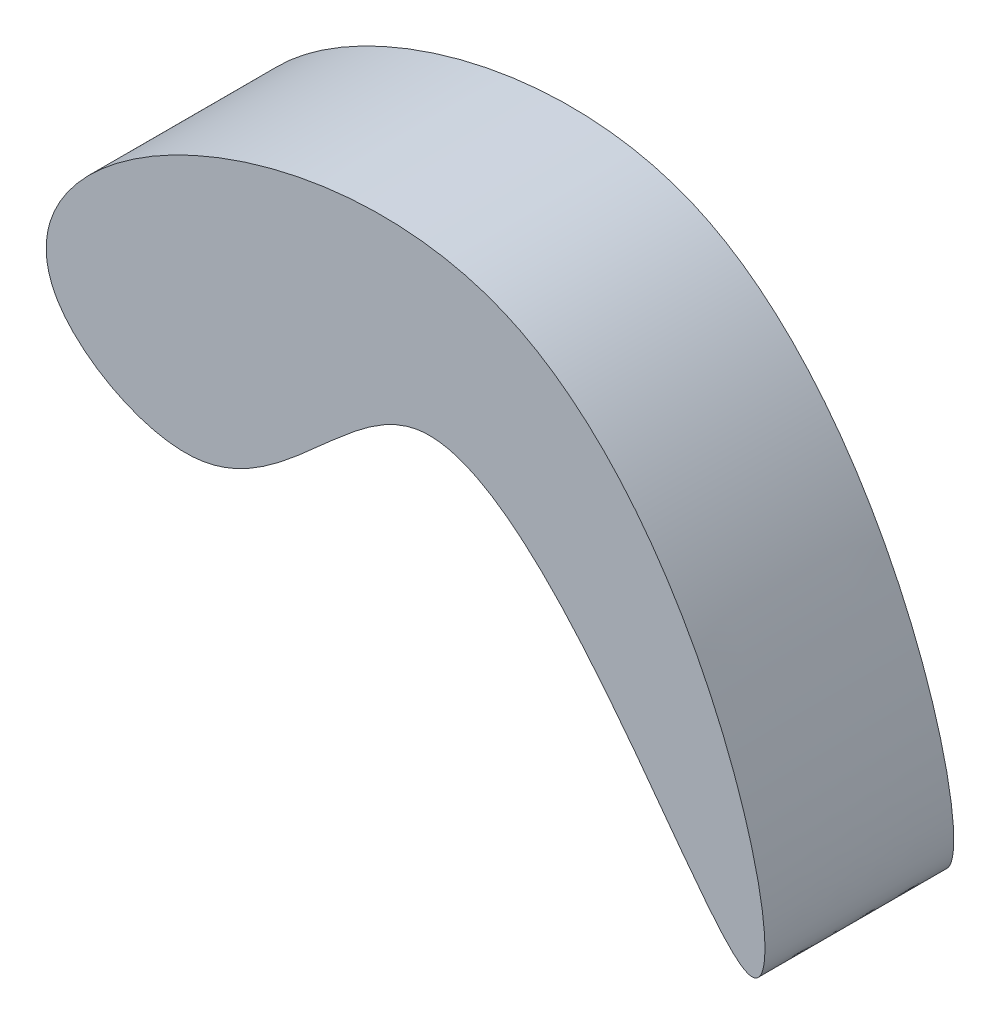
ISO-10303-21;
HEADER;
FILE_DESCRIPTION(('STEP AP214'),'2;1');
FILE_NAME('part.step','',(''),(''),'','','');
FILE_SCHEMA(('AUTOMOTIVE_DESIGN { 1 0 10303 214 1 1 1 1 }'));
ENDSEC;
DATA;
#1=APPLICATION_CONTEXT('core data for automotive mechanical design processes');
#2=APPLICATION_PROTOCOL_DEFINITION('international standard','automotive_design',2000,#1);
#3=PRODUCT_CONTEXT('',#1,'mechanical');
#4=PRODUCT('Part','Part','',(#3));
#5=PRODUCT_RELATED_PRODUCT_CATEGORY('part','',(#4));
#6=PRODUCT_DEFINITION_FORMATION('','',#4);
#7=PRODUCT_DEFINITION_CONTEXT('part definition',#1,'design');
#8=PRODUCT_DEFINITION('design','',#6,#7);
#9=PRODUCT_DEFINITION_SHAPE('','',#8);
#10=(LENGTH_UNIT() NAMED_UNIT(*) SI_UNIT(.MILLI.,.METRE.));
#11=(NAMED_UNIT(*) PLANE_ANGLE_UNIT() SI_UNIT($,.RADIAN.));
#12=(NAMED_UNIT(*) SI_UNIT($,.STERADIAN.) SOLID_ANGLE_UNIT());
#13=UNCERTAINTY_MEASURE_WITH_UNIT(LENGTH_MEASURE(1.E-05),#10,'distance_accuracy_value','');
#14=(GEOMETRIC_REPRESENTATION_CONTEXT(3) GLOBAL_UNCERTAINTY_ASSIGNED_CONTEXT((#13)) GLOBAL_UNIT_ASSIGNED_CONTEXT((#10,
#11,#12)) REPRESENTATION_CONTEXT('',''));
#15=CARTESIAN_POINT('',(0.,0.,0.));
#16=DIRECTION('',(0.,0.,1.));
#17=DIRECTION('',(1.,0.,0.));
#18=AXIS2_PLACEMENT_3D('',#15,#16,#17);
#19=CARTESIAN_POINT('',(3.56664575303966,23.2194553590261,-10.));
#20=CARTESIAN_POINT('',(5.69515383684165,19.7726400859584,-10.));
#21=CARTESIAN_POINT('',(20.7568728150862,11.5808963935715,-10.));
#22=CARTESIAN_POINT('',(39.2452653300195,47.1042954283447,-10.));
#23=CARTESIAN_POINT('',(77.5982814444877,-28.8795470727316,-10.));
#24=CARTESIAN_POINT('',(55.2870831732471,66.6804112958299,-10.));
#25=CARTESIAN_POINT('',(-3.34221028566064,34.4073623699699,-10.));
#26=CARTESIAN_POINT('',(3.56664575303966,23.2194553590261,-10.));
#27=B_SPLINE_CURVE_WITH_KNOTS('',3,(#19,#20,#21,#22,#23,#24,#25,#26),.UNSPECIFIED.,.T.,.F.,(4,1,
1,1,1,4),(0.,0.0814706657795032,0.222276328373781,0.462196474158908,0.735556982127009,1.),.UNSPECIFIED.);
#28=DIRECTION('',(0.,0.,1.));
#29=VECTOR('',#28,1.);
#30=SURFACE_OF_LINEAR_EXTRUSION('',#27,#29);
#31=CARTESIAN_POINT('',(3.56664575303966,23.2194553590261,-10.));
#32=VERTEX_POINT('',#31);
#33=EDGE_CURVE('E10',#32,#32,#27,.T.);
#34=ORIENTED_EDGE('',*,*,#33,.T.);
#35=EDGE_LOOP('',(#34));
#36=FACE_BOUND('',#35,.T.);
#37=CARTESIAN_POINT('',(3.56664575303966,23.2194553590261,6.99999999999999));
#38=CARTESIAN_POINT('',(5.69515383684165,19.7726400859584,6.99999999999999));
#39=CARTESIAN_POINT('',(20.7568728150862,11.5808963935715,6.99999999999999));
#40=CARTESIAN_POINT('',(39.2452653300195,47.1042954283447,6.99999999999999));
#41=CARTESIAN_POINT('',(77.5982814444877,-28.8795470727316,6.99999999999999));
#42=CARTESIAN_POINT('',(55.2870831732471,66.6804112958299,6.99999999999999));
#43=CARTESIAN_POINT('',(-3.34221028566064,34.4073623699699,6.99999999999999));
#44=CARTESIAN_POINT('',(3.56664575303966,23.2194553590261,6.99999999999999));
#45=B_SPLINE_CURVE_WITH_KNOTS('',3,(#37,#38,#39,#40,#41,#42,#43,#44),.UNSPECIFIED.,.T.,.F.,(4,1,
1,1,1,4),(0.,0.0814706657795032,0.222276328373781,0.462196474158908,0.735556982127009,1.),.UNSPECIFIED.);
#46=CARTESIAN_POINT('',(3.56664575303966,23.2194553590261,6.99999999999999));
#47=VERTEX_POINT('',#46);
#48=EDGE_CURVE('E40',#47,#47,#45,.T.);
#49=ORIENTED_EDGE('',*,*,#48,.F.);
#50=EDGE_LOOP('',(#49));
#51=FACE_BOUND('',#50,.T.);
#52=ADVANCED_FACE('F31',(#36,#51),#30,.T.);
#53=CARTESIAN_POINT('',(67.140105202635,3.14654257477529,-10.));
#54=DIRECTION('',(0.,0.,1.));
#55=DIRECTION('',(1.,0.,0.));
#56=AXIS2_PLACEMENT_3D('',#53,#54,#55);
#57=PLANE('',#56);
#58=ORIENTED_EDGE('',*,*,#33,.F.);
#59=EDGE_LOOP('',(#58));
#60=FACE_BOUND('',#59,.T.);
#61=ADVANCED_FACE('F54',(#60),#57,.F.);
#62=CARTESIAN_POINT('',(67.140105202635,3.14654257477529,6.99999999999999));
#63=DIRECTION('',(0.,0.,1.));
#64=DIRECTION('',(1.,0.,0.));
#65=AXIS2_PLACEMENT_3D('',#62,#63,#64);
#66=PLANE('',#65);
#67=ORIENTED_EDGE('',*,*,#48,.T.);
#68=EDGE_LOOP('',(#67));
#69=FACE_BOUND('',#68,.T.);
#70=ADVANCED_FACE('F51',(#69),#66,.T.);
#71=CLOSED_SHELL('',(#52,#61,#70));
#72=MANIFOLD_SOLID_BREP('B2',#71);
#73=ADVANCED_BREP_SHAPE_REPRESENTATION('',(#18,#72),#14);
#74=SHAPE_DEFINITION_REPRESENTATION(#9,#73);
ENDSEC;
END-ISO-10303-21;
